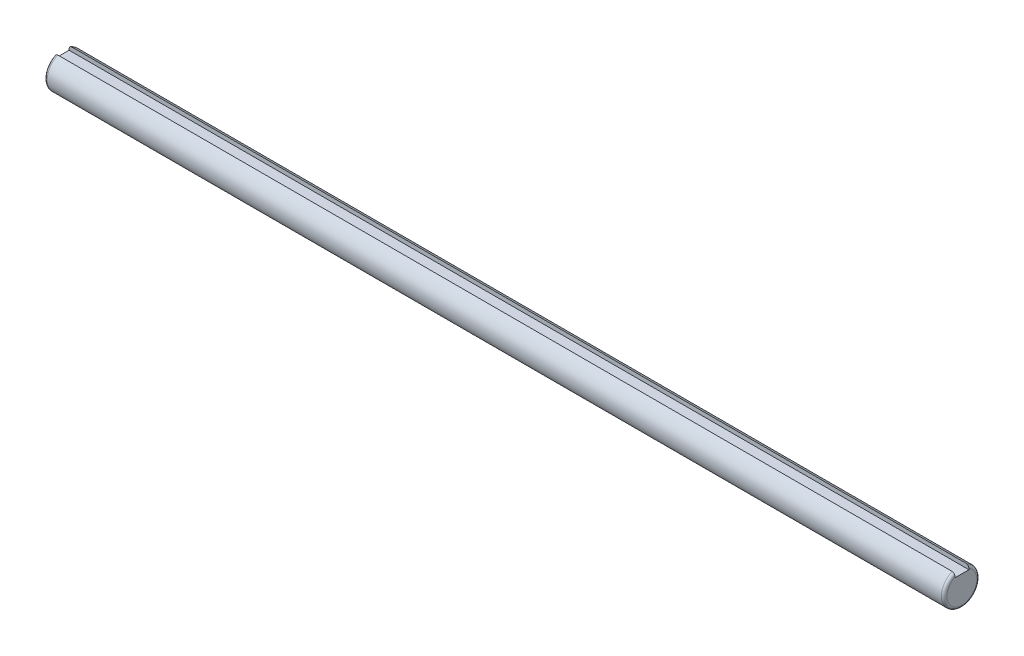
ISO-10303-21;
HEADER;
FILE_DESCRIPTION(('STEP AP214'),'2;1');
FILE_NAME('part.step','',(''),(''),'','','');
FILE_SCHEMA(('AUTOMOTIVE_DESIGN { 1 0 10303 214 1 1 1 1 }'));
ENDSEC;
DATA;
#1=APPLICATION_CONTEXT('core data for automotive mechanical design processes');
#2=APPLICATION_PROTOCOL_DEFINITION('international standard','automotive_design',2000,#1);
#3=PRODUCT_CONTEXT('',#1,'mechanical');
#4=PRODUCT('Part','Part','',(#3));
#5=PRODUCT_RELATED_PRODUCT_CATEGORY('part','',(#4));
#6=PRODUCT_DEFINITION_FORMATION('','',#4);
#7=PRODUCT_DEFINITION_CONTEXT('part definition',#1,'design');
#8=PRODUCT_DEFINITION('design','',#6,#7);
#9=PRODUCT_DEFINITION_SHAPE('','',#8);
#10=(LENGTH_UNIT() NAMED_UNIT(*) SI_UNIT(.MILLI.,.METRE.));
#11=(NAMED_UNIT(*) PLANE_ANGLE_UNIT() SI_UNIT($,.RADIAN.));
#12=(NAMED_UNIT(*) SI_UNIT($,.STERADIAN.) SOLID_ANGLE_UNIT());
#13=UNCERTAINTY_MEASURE_WITH_UNIT(LENGTH_MEASURE(1.E-05),#10,'distance_accuracy_value','');
#14=(GEOMETRIC_REPRESENTATION_CONTEXT(3) GLOBAL_UNCERTAINTY_ASSIGNED_CONTEXT((#13)) GLOBAL_UNIT_ASSIGNED_CONTEXT((#10,
#11,#12)) REPRESENTATION_CONTEXT('',''));
#15=CARTESIAN_POINT('',(0.,0.,0.));
#16=DIRECTION('',(0.,0.,1.));
#17=DIRECTION('',(1.,0.,0.));
#18=AXIS2_PLACEMENT_3D('',#15,#16,#17);
#19=CARTESIAN_POINT('',(322.5,5.83716540796986,2.5));
#20=DIRECTION('',(0.,0.,1.));
#21=DIRECTION('',(0.,-1.,0.));
#22=AXIS2_PLACEMENT_3D('',#19,#20,#21);
#23=PLANE('',#22);
#24=DIRECTION('',(-1.,0.,0.));
#25=VECTOR('',#24,1.);
#26=CARTESIAN_POINT('',(322.5,5.83716540796987,2.5));
#27=LINE('',#26,#25);
#28=CARTESIAN_POINT('',(321.5,5.83716540796987,2.5));
#29=VERTEX_POINT('',#28);
#30=CARTESIAN_POINT('',(1.00000000000011,5.83716540796987,2.5));
#31=VERTEX_POINT('',#30);
#32=EDGE_CURVE('E135',#29,#31,#27,.T.);
#33=ORIENTED_EDGE('',*,*,#32,.F.);
#34=CARTESIAN_POINT('',(321.5,5.83716540796987,2.5));
#35=CARTESIAN_POINT('',(321.526417781917,5.83716620547208,2.5));
#36=CARTESIAN_POINT('',(321.552822369839,5.83602578607929,2.5));
#37=CARTESIAN_POINT('',(321.605431289137,5.83148289467916,2.5));
#38=CARTESIAN_POINT('',(321.631635657347,5.8280808493834,2.5));
#39=CARTESIAN_POINT('',(321.70951555561,5.81454471373635,2.5));
#40=CARTESIAN_POINT('',(321.760650264978,5.80108028143882,2.5));
#41=CARTESIAN_POINT('',(321.859897119657,5.76579588179092,2.5));
#42=CARTESIAN_POINT('',(321.908009863229,5.74397757437505,2.5));
#43=CARTESIAN_POINT('',(322.000048933015,5.69279033199379,2.5));
#44=CARTESIAN_POINT('',(322.043973637861,5.6634184888707,2.5));
#45=CARTESIAN_POINT('',(322.12784449619,5.59717593519956,2.5));
#46=CARTESIAN_POINT('',(322.167636969059,5.56011125276586,2.5));
#47=CARTESIAN_POINT('',(322.240961654286,5.48025579990871,2.5));
#48=CARTESIAN_POINT('',(322.274493054011,5.43746428742909,2.5));
#49=CARTESIAN_POINT('',(322.337097553544,5.34394734093399,2.5));
#50=CARTESIAN_POINT('',(322.365638239899,5.29286610683251,2.5));
#51=CARTESIAN_POINT('',(322.414601424252,5.18691647613434,2.5));
#52=CARTESIAN_POINT('',(322.435016006278,5.13204444752137,2.5));
#53=CARTESIAN_POINT('',(322.467638809473,5.01980738578591,2.5));
#54=CARTESIAN_POINT('',(322.479829232398,4.96243722996997,2.5));
#55=CARTESIAN_POINT('',(322.496008787884,4.84668223284521,2.5));
#56=CARTESIAN_POINT('',(322.500016966845,4.78830006777297,2.5));
#57=CARTESIAN_POINT('',(322.5,4.7299577165129,2.5));
#58=B_SPLINE_CURVE_WITH_KNOTS('',3,(#34,#35,#36,#37,#38,#39,#40,#41,#42,#43,#44,#45,#46,#47,#48,
#49,#50,#51,#52,#53,#54,#55,#56,#57),.UNSPECIFIED.,.F.,.F.,(4,2,2,2,2,2,2,2,2,2,2,4),(0.,
0.0792028069304454,0.158390674534827,0.316196872522573,0.473971730309061,0.631807423564081,
0.794253244483557,0.956720134798707,1.13153289839346,1.30651553994288,1.48187566426396,
1.65682712254984),.UNSPECIFIED.);
#59=CARTESIAN_POINT('',(322.5,4.72995771651291,2.5));
#60=VERTEX_POINT('',#59);
#61=EDGE_CURVE('E54',#29,#60,#58,.T.);
#62=ORIENTED_EDGE('',*,*,#61,.T.);
#63=DIRECTION('',(0.,1.,0.));
#64=VECTOR('',#63,1.);
#65=CARTESIAN_POINT('',(322.5,5.83716540796986,2.5));
#66=LINE('',#65,#64);
#67=CARTESIAN_POINT('',(322.5,4.35,2.5));
#68=VERTEX_POINT('',#67);
#69=EDGE_CURVE('E110',#68,#60,#66,.T.);
#70=ORIENTED_EDGE('',*,*,#69,.F.);
#71=DIRECTION('',(-1.,0.,0.));
#72=VECTOR('',#71,1.);
#73=CARTESIAN_POINT('',(322.5,4.35,2.5));
#74=LINE('',#73,#72);
#75=CARTESIAN_POINT('',(0.,4.35,2.5));
#76=VERTEX_POINT('',#75);
#77=EDGE_CURVE('E119',#68,#76,#74,.T.);
#78=ORIENTED_EDGE('',*,*,#77,.T.);
#79=DIRECTION('',(0.,1.,0.));
#80=VECTOR('',#79,1.);
#81=CARTESIAN_POINT('',(0.,5.83716540796986,2.5));
#82=LINE('',#81,#80);
#83=CARTESIAN_POINT('',(0.,4.72995771651291,2.5));
#84=VERTEX_POINT('',#83);
#85=EDGE_CURVE('E128',#76,#84,#82,.T.);
#86=ORIENTED_EDGE('',*,*,#85,.T.);
#87=CARTESIAN_POINT('',(0.,4.72995771651291,2.5));
#88=CARTESIAN_POINT('',(-3.49224604547411E-05,4.79815495295292,2.5));
#89=CARTESIAN_POINT('',(0.00545383113127034,4.86642835505546,2.5));
#90=CARTESIAN_POINT('',(0.0276326357104394,5.00140674130414,2.5));
#91=CARTESIAN_POINT('',(0.0443685085555755,5.06810414939647,2.5));
#92=CARTESIAN_POINT('',(0.0892596016764846,5.19779651980638,2.5));
#93=CARTESIAN_POINT('',(0.117446202183975,5.26078075877814,2.5));
#94=CARTESIAN_POINT('',(0.18489832069816,5.38041382098597,2.5));
#95=CARTESIAN_POINT('',(0.224143066406,5.43707424728726,2.5));
#96=CARTESIAN_POINT('',(0.309181975761681,5.53732052185738,2.5));
#97=CARTESIAN_POINT('',(0.354152438858777,5.58160392487816,2.5));
#98=CARTESIAN_POINT('',(0.451624860267822,5.66100297797419,2.5));
#99=CARTESIAN_POINT('',(0.504126441235087,5.69611908712584,2.5));
#100=CARTESIAN_POINT('',(0.609498139947608,5.75253764416062,2.5));
#101=CARTESIAN_POINT('',(0.661825488620208,5.77485815049173,2.5));
#102=CARTESIAN_POINT('',(0.769607070532428,5.80964925673995,2.5));
#103=CARTESIAN_POINT('',(0.825054731223909,5.82213978727189,2.5));
#104=CARTESIAN_POINT('',(0.900822421796418,5.832019252388,2.5));
#105=CARTESIAN_POINT('',(0.920624677547985,5.83394926288726,2.5));
#106=CARTESIAN_POINT('',(0.960281305820981,5.83652065728398,2.5));
#107=CARTESIAN_POINT('',(0.980135546674135,5.83716407115671,2.5));
#108=CARTESIAN_POINT('',(0.999999999999975,5.8371654079699,2.5));
#109=B_SPLINE_CURVE_WITH_KNOTS('',3,(#87,#88,#89,#90,#91,#92,#93,#94,#95,#96,#97,#98,#99,#100,
#101,#102,#103,#104,#105,#106,#107,#108),.UNSPECIFIED.,.F.,.F.,(4,2,2,2,2,2,2,2,2,2,4),(0.,
0.204490227155579,0.409818659030317,0.615713621903897,0.821224368313086,1.00952481596023,
1.19781583215624,1.36761149820076,1.5370620043193,1.59671880426023,1.65628140398078),.UNSPECIFIED.);
#110=EDGE_CURVE('E66',#84,#31,#109,.T.);
#111=ORIENTED_EDGE('',*,*,#110,.T.);
#112=EDGE_LOOP('',(#33,#62,#70,#78,#86,#111));
#113=FACE_BOUND('',#112,.T.);
#114=ADVANCED_FACE('F45',(#113),#23,.F.);
#115=CARTESIAN_POINT('',(322.5,0.,0.));
#116=DIRECTION('',(-1.,0.,0.));
#117=DIRECTION('',(0.,0.,1.));
#118=AXIS2_PLACEMENT_3D('',#115,#116,#117);
#119=CYLINDRICAL_SURFACE('',#118,6.35);
#120=DIRECTION('',(-1.,0.,0.));
#121=VECTOR('',#120,1.);
#122=CARTESIAN_POINT('',(322.5,5.83716540796986,-2.5));
#123=LINE('',#122,#121);
#124=CARTESIAN_POINT('',(321.5,5.83716540796986,-2.5));
#125=VERTEX_POINT('',#124);
#126=CARTESIAN_POINT('',(1.00000000000011,5.83716540796986,-2.5));
#127=VERTEX_POINT('',#126);
#128=EDGE_CURVE('E118',#125,#127,#123,.T.);
#129=ORIENTED_EDGE('',*,*,#128,.F.);
#130=CARTESIAN_POINT('',(321.5,0.,0.));
#131=DIRECTION('',(1.,0.,0.));
#132=DIRECTION('',(0.,0.,-1.));
#133=AXIS2_PLACEMENT_3D('',#130,#131,#132);
#134=CIRCLE('',#133,6.35);
#135=EDGE_CURVE('E177',#125,#29,#134,.F.);
#136=ORIENTED_EDGE('',*,*,#135,.T.);
#137=ORIENTED_EDGE('',*,*,#32,.T.);
#138=CARTESIAN_POINT('',(1.,0.,0.));
#139=DIRECTION('',(1.,0.,0.));
#140=DIRECTION('',(0.,0.,-1.));
#141=AXIS2_PLACEMENT_3D('',#138,#139,#140);
#142=CIRCLE('',#141,6.35);
#143=EDGE_CURVE('E178',#31,#127,#142,.T.);
#144=ORIENTED_EDGE('',*,*,#143,.T.);
#145=EDGE_LOOP('',(#129,#136,#137,#144));
#146=FACE_BOUND('',#145,.T.);
#147=ADVANCED_FACE('F155',(#146),#119,.T.);
#148=CARTESIAN_POINT('',(322.5,5.83716540796986,-2.5));
#149=DIRECTION('',(0.,0.,-1.));
#150=DIRECTION('',(0.,1.,0.));
#151=AXIS2_PLACEMENT_3D('',#148,#149,#150);
#152=PLANE('',#151);
#153=DIRECTION('',(0.,-1.,0.));
#154=VECTOR('',#153,1.);
#155=CARTESIAN_POINT('',(322.5,5.83716540796986,-2.5));
#156=LINE('',#155,#154);
#157=CARTESIAN_POINT('',(322.5,4.72995771651291,-2.5));
#158=VERTEX_POINT('',#157);
#159=CARTESIAN_POINT('',(322.5,4.35,-2.5));
#160=VERTEX_POINT('',#159);
#161=EDGE_CURVE('E100',#158,#160,#156,.T.);
#162=ORIENTED_EDGE('',*,*,#161,.F.);
#163=CARTESIAN_POINT('',(322.5,4.72995771651291,-2.5));
#164=CARTESIAN_POINT('',(322.50003492246,4.79815495295291,-2.5));
#165=CARTESIAN_POINT('',(322.494546168869,4.86642835505545,-2.5));
#166=CARTESIAN_POINT('',(322.47236736429,5.00140674130414,-2.5));
#167=CARTESIAN_POINT('',(322.455631491444,5.06810414939647,-2.5));
#168=CARTESIAN_POINT('',(322.410740398324,5.19779651980637,-2.5));
#169=CARTESIAN_POINT('',(322.382553797816,5.26078075877811,-2.5));
#170=CARTESIAN_POINT('',(322.315101679302,5.38041382098594,-2.5));
#171=CARTESIAN_POINT('',(322.275856933594,5.43707424728723,-2.5));
#172=CARTESIAN_POINT('',(322.190818024238,5.53732052185733,-2.5));
#173=CARTESIAN_POINT('',(322.145847561141,5.5816039248781,-2.5));
#174=CARTESIAN_POINT('',(322.048375139732,5.66100297797412,-2.5));
#175=CARTESIAN_POINT('',(321.995873558765,5.69611908712579,-2.5));
#176=CARTESIAN_POINT('',(321.890501860052,5.7525376441606,-2.5));
#177=CARTESIAN_POINT('',(321.83817451138,5.77485815049172,-2.5));
#178=CARTESIAN_POINT('',(321.730392929468,5.80964925673995,-2.5));
#179=CARTESIAN_POINT('',(321.674945268776,5.82213978727189,-2.5));
#180=CARTESIAN_POINT('',(321.599177578204,5.832019252388,-2.5));
#181=CARTESIAN_POINT('',(321.579375322452,5.83394926288726,-2.5));
#182=CARTESIAN_POINT('',(321.539718694179,5.83652065728398,-2.5));
#183=CARTESIAN_POINT('',(321.519864453326,5.83716407115672,-2.5));
#184=CARTESIAN_POINT('',(321.5,5.8371654079699,-2.5));
#185=B_SPLINE_CURVE_WITH_KNOTS('',3,(#163,#164,#165,#166,#167,#168,#169,#170,#171,#172,#173,
#174,#175,#176,#177,#178,#179,#180,#181,#182,#183,#184),.UNSPECIFIED.,.F.,.F.,(4,2,2,2,2,2,2,2,
2,2,4),(0.,0.204490227155576,0.409818659030304,0.615713621903874,0.821224368313038,
1.00952481596011,1.19781583215621,1.36761149820073,1.53706200431928,1.59671880426024,
1.6562814039808),.UNSPECIFIED.);
#186=EDGE_CURVE('E145',#158,#125,#185,.T.);
#187=ORIENTED_EDGE('',*,*,#186,.T.);
#188=ORIENTED_EDGE('',*,*,#128,.T.);
#189=CARTESIAN_POINT('',(0.99999999999998,5.83716540796986,-2.5));
#190=CARTESIAN_POINT('',(0.973582218082631,5.83716620547208,-2.5));
#191=CARTESIAN_POINT('',(0.947177630161174,5.83602578607929,-2.5));
#192=CARTESIAN_POINT('',(0.8945687108629,5.83148289467915,-2.5));
#193=CARTESIAN_POINT('',(0.86836434265288,5.8280808493834,-2.5));
#194=CARTESIAN_POINT('',(0.790484444389836,5.81454471373635,-2.5));
#195=CARTESIAN_POINT('',(0.739349735021574,5.80108028143882,-2.5));
#196=CARTESIAN_POINT('',(0.640102880343505,5.76579588179091,-2.5));
#197=CARTESIAN_POINT('',(0.591990136771416,5.74397757437503,-2.5));
#198=CARTESIAN_POINT('',(0.499951066984926,5.69279033199376,-2.5));
#199=CARTESIAN_POINT('',(0.456026362139448,5.66341848887067,-2.5));
#200=CARTESIAN_POINT('',(0.372155503810426,5.59717593519952,-2.5));
#201=CARTESIAN_POINT('',(0.332363030941099,5.56011125276582,-2.5));
#202=CARTESIAN_POINT('',(0.259038345714426,5.4802557999087,-2.5));
#203=CARTESIAN_POINT('',(0.225506945988927,5.43746428742909,-2.5));
#204=CARTESIAN_POINT('',(0.162902446456385,5.34394734093402,-2.5));
#205=CARTESIAN_POINT('',(0.134361760100641,5.29286610683254,-2.5));
#206=CARTESIAN_POINT('',(0.0853985757478659,5.18691647613435,-2.5));
#207=CARTESIAN_POINT('',(0.0649839937220233,5.13204444752136,-2.5));
#208=CARTESIAN_POINT('',(0.0323611905265052,5.01980738578589,-2.5));
#209=CARTESIAN_POINT('',(0.0201707676022822,4.96243722996996,-2.5));
#210=CARTESIAN_POINT('',(0.00399121211636699,4.84668223284522,-2.5));
#211=CARTESIAN_POINT('',(-1.69668449643818E-05,4.78830006777298,-2.5));
#212=CARTESIAN_POINT('',(0.,4.72995771651291,-2.5));
#213=B_SPLINE_CURVE_WITH_KNOTS('',3,(#189,#190,#191,#192,#193,#194,#195,#196,#197,#198,#199,
#200,#201,#202,#203,#204,#205,#206,#207,#208,#209,#210,#211,#212),.UNSPECIFIED.,.F.,.F.,(4,2,2,
2,2,2,2,2,2,2,2,4),(0.,0.0792028069305205,0.158390674534822,0.31619687252256,0.473971730309072,
0.631807423564143,0.79425324448356,0.956720134798642,1.13153289839344,1.30651553994287,
1.48187566426394,1.65682712254981),.UNSPECIFIED.);
#214=CARTESIAN_POINT('',(0.,4.72995771651291,-2.5));
#215=VERTEX_POINT('',#214);
#216=EDGE_CURVE('E138',#127,#215,#213,.T.);
#217=ORIENTED_EDGE('',*,*,#216,.T.);
#218=DIRECTION('',(0.,-1.,0.));
#219=VECTOR('',#218,1.);
#220=CARTESIAN_POINT('',(0.,5.83716540796986,-2.5));
#221=LINE('',#220,#219);
#222=CARTESIAN_POINT('',(0.,4.35,-2.5));
#223=VERTEX_POINT('',#222);
#224=EDGE_CURVE('E115',#215,#223,#221,.T.);
#225=ORIENTED_EDGE('',*,*,#224,.T.);
#226=DIRECTION('',(-1.,0.,0.));
#227=VECTOR('',#226,1.);
#228=CARTESIAN_POINT('',(322.5,4.35,-2.5));
#229=LINE('',#228,#227);
#230=EDGE_CURVE('E113',#160,#223,#229,.T.);
#231=ORIENTED_EDGE('',*,*,#230,.F.);
#232=EDGE_LOOP('',(#162,#187,#188,#217,#225,#231));
#233=FACE_BOUND('',#232,.T.);
#234=ADVANCED_FACE('F114',(#233),#152,.F.);
#235=CARTESIAN_POINT('',(322.5,4.35,-2.5));
#236=DIRECTION('',(0.,-1.,0.));
#237=DIRECTION('',(0.,0.,-1.));
#238=AXIS2_PLACEMENT_3D('',#235,#236,#237);
#239=PLANE('',#238);
#240=DIRECTION('',(0.,0.,1.));
#241=VECTOR('',#240,1.);
#242=CARTESIAN_POINT('',(0.,4.35,-2.5));
#243=LINE('',#242,#241);
#244=EDGE_CURVE('E131',#223,#76,#243,.T.);
#245=ORIENTED_EDGE('',*,*,#244,.T.);
#246=ORIENTED_EDGE('',*,*,#77,.F.);
#247=DIRECTION('',(0.,0.,1.));
#248=VECTOR('',#247,1.);
#249=CARTESIAN_POINT('',(322.5,4.35,-2.5));
#250=LINE('',#249,#248);
#251=EDGE_CURVE('E105',#160,#68,#250,.T.);
#252=ORIENTED_EDGE('',*,*,#251,.F.);
#253=ORIENTED_EDGE('',*,*,#230,.T.);
#254=EDGE_LOOP('',(#245,#246,#252,#253));
#255=FACE_BOUND('',#254,.T.);
#256=ADVANCED_FACE('F121',(#255),#239,.F.);
#257=CARTESIAN_POINT('',(322.5,0.,0.));
#258=DIRECTION('',(1.,0.,0.));
#259=DIRECTION('',(0.,0.,-1.));
#260=AXIS2_PLACEMENT_3D('',#257,#258,#259);
#261=PLANE('',#260);
#262=ORIENTED_EDGE('',*,*,#69,.T.);
#263=CARTESIAN_POINT('',(322.5,0.,0.));
#264=DIRECTION('',(1.,0.,0.));
#265=DIRECTION('',(0.,0.,-1.));
#266=AXIS2_PLACEMENT_3D('',#263,#264,#265);
#267=CIRCLE('',#266,5.35);
#268=EDGE_CURVE('E108',#60,#158,#267,.T.);
#269=ORIENTED_EDGE('',*,*,#268,.T.);
#270=ORIENTED_EDGE('',*,*,#161,.T.);
#271=ORIENTED_EDGE('',*,*,#251,.T.);
#272=EDGE_LOOP('',(#262,#269,#270,#271));
#273=FACE_BOUND('',#272,.T.);
#274=ADVANCED_FACE('F103',(#273),#261,.T.);
#275=CARTESIAN_POINT('',(0.,0.,0.));
#276=DIRECTION('',(1.,0.,0.));
#277=DIRECTION('',(0.,0.,-1.));
#278=AXIS2_PLACEMENT_3D('',#275,#276,#277);
#279=PLANE('',#278);
#280=ORIENTED_EDGE('',*,*,#224,.F.);
#281=CARTESIAN_POINT('',(0.,0.,0.));
#282=DIRECTION('',(1.,0.,0.));
#283=DIRECTION('',(0.,0.,-1.));
#284=AXIS2_PLACEMENT_3D('',#281,#282,#283);
#285=CIRCLE('',#284,5.35);
#286=EDGE_CURVE('E13',#215,#84,#285,.F.);
#287=ORIENTED_EDGE('',*,*,#286,.T.);
#288=ORIENTED_EDGE('',*,*,#85,.F.);
#289=ORIENTED_EDGE('',*,*,#244,.F.);
#290=EDGE_LOOP('',(#280,#287,#288,#289));
#291=FACE_BOUND('',#290,.T.);
#292=ADVANCED_FACE('F185',(#291),#279,.F.);
#293=CARTESIAN_POINT('',(321.5,0.,0.));
#294=DIRECTION('',(1.,0.,0.));
#295=DIRECTION('',(0.,0.,-1.));
#296=AXIS2_PLACEMENT_3D('',#293,#294,#295);
#297=TOROIDAL_SURFACE('',#296,5.35,1.);
#298=ORIENTED_EDGE('',*,*,#61,.F.);
#299=ORIENTED_EDGE('',*,*,#135,.F.);
#300=ORIENTED_EDGE('',*,*,#186,.F.);
#301=ORIENTED_EDGE('',*,*,#268,.F.);
#302=EDGE_LOOP('',(#298,#299,#300,#301));
#303=FACE_BOUND('',#302,.T.);
#304=ADVANCED_FACE('F163',(#303),#297,.T.);
#305=CARTESIAN_POINT('',(1.,0.,0.));
#306=DIRECTION('',(1.,0.,0.));
#307=DIRECTION('',(0.,0.,-1.));
#308=AXIS2_PLACEMENT_3D('',#305,#306,#307);
#309=TOROIDAL_SURFACE('',#308,5.35,1.);
#310=ORIENTED_EDGE('',*,*,#110,.F.);
#311=ORIENTED_EDGE('',*,*,#286,.F.);
#312=ORIENTED_EDGE('',*,*,#216,.F.);
#313=ORIENTED_EDGE('',*,*,#143,.F.);
#314=EDGE_LOOP('',(#310,#311,#312,#313));
#315=FACE_BOUND('',#314,.T.);
#316=ADVANCED_FACE('F47',(#315),#309,.T.);
#317=CLOSED_SHELL('',(#114,#147,#234,#256,#274,#292,#304,#316));
#318=MANIFOLD_SOLID_BREP('B2',#317);
#319=ADVANCED_BREP_SHAPE_REPRESENTATION('',(#18,#318),#14);
#320=SHAPE_DEFINITION_REPRESENTATION(#9,#319);
ENDSEC;
END-ISO-10303-21;
